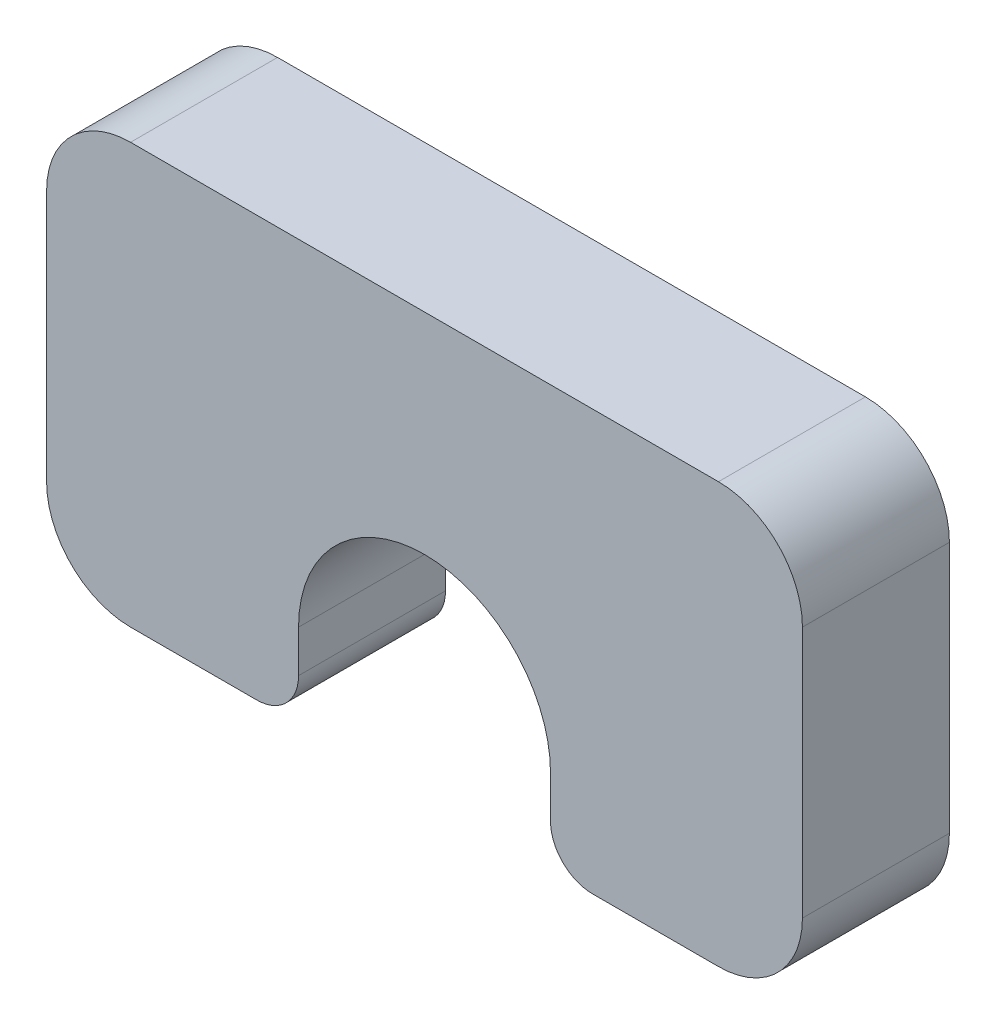
ISO-10303-21;
HEADER;
FILE_DESCRIPTION(('STEP AP214'),'2;1');
FILE_NAME('part.step','',(''),(''),'','','');
FILE_SCHEMA(('AUTOMOTIVE_DESIGN { 1 0 10303 214 1 1 1 1 }'));
ENDSEC;
DATA;
#1=APPLICATION_CONTEXT('core data for automotive mechanical design processes');
#2=APPLICATION_PROTOCOL_DEFINITION('international standard','automotive_design',2000,#1);
#3=PRODUCT_CONTEXT('',#1,'mechanical');
#4=PRODUCT('Part','Part','',(#3));
#5=PRODUCT_RELATED_PRODUCT_CATEGORY('part','',(#4));
#6=PRODUCT_DEFINITION_FORMATION('','',#4);
#7=PRODUCT_DEFINITION_CONTEXT('part definition',#1,'design');
#8=PRODUCT_DEFINITION('design','',#6,#7);
#9=PRODUCT_DEFINITION_SHAPE('','',#8);
#10=(LENGTH_UNIT() NAMED_UNIT(*) SI_UNIT(.MILLI.,.METRE.));
#11=(NAMED_UNIT(*) PLANE_ANGLE_UNIT() SI_UNIT($,.RADIAN.));
#12=(NAMED_UNIT(*) SI_UNIT($,.STERADIAN.) SOLID_ANGLE_UNIT());
#13=UNCERTAINTY_MEASURE_WITH_UNIT(LENGTH_MEASURE(1.E-05),#10,'distance_accuracy_value','');
#14=(GEOMETRIC_REPRESENTATION_CONTEXT(3) GLOBAL_UNCERTAINTY_ASSIGNED_CONTEXT((#13)) GLOBAL_UNIT_ASSIGNED_CONTEXT((#10,
#11,#12)) REPRESENTATION_CONTEXT('',''));
#15=CARTESIAN_POINT('',(0.,0.,0.));
#16=DIRECTION('',(0.,0.,1.));
#17=DIRECTION('',(1.,0.,0.));
#18=AXIS2_PLACEMENT_3D('',#15,#16,#17);
#19=CARTESIAN_POINT('',(13.,1.,1.75));
#20=DIRECTION('',(0.,0.,-1.));
#21=DIRECTION('',(-1.,0.,0.));
#22=AXIS2_PLACEMENT_3D('',#19,#20,#21);
#23=CYLINDRICAL_SURFACE('',#22,1.);
#24=CARTESIAN_POINT('',(13.,1.,-1.75));
#25=DIRECTION('',(0.,0.,1.));
#26=DIRECTION('',(1.,0.,0.));
#27=AXIS2_PLACEMENT_3D('',#24,#25,#26);
#28=CIRCLE('',#27,1.);
#29=CARTESIAN_POINT('',(12.,1.00000000000001,-1.75));
#30=VERTEX_POINT('',#29);
#31=CARTESIAN_POINT('',(13.,0.,-1.75));
#32=VERTEX_POINT('',#31);
#33=EDGE_CURVE('E174',#30,#32,#28,.T.);
#34=ORIENTED_EDGE('',*,*,#33,.T.);
#35=DIRECTION('',(0.,0.,-1.));
#36=VECTOR('',#35,1.);
#37=CARTESIAN_POINT('',(13.,0.,1.75));
#38=LINE('',#37,#36);
#39=CARTESIAN_POINT('',(13.,0.,1.75));
#40=VERTEX_POINT('',#39);
#41=EDGE_CURVE('E11',#40,#32,#38,.T.);
#42=ORIENTED_EDGE('',*,*,#41,.F.);
#43=CARTESIAN_POINT('',(13.,1.,1.75));
#44=DIRECTION('',(0.,0.,1.));
#45=DIRECTION('',(1.,0.,0.));
#46=AXIS2_PLACEMENT_3D('',#43,#44,#45);
#47=CIRCLE('',#46,1.);
#48=CARTESIAN_POINT('',(12.,1.00000000000001,1.75));
#49=VERTEX_POINT('',#48);
#50=EDGE_CURVE('E214',#49,#40,#47,.T.);
#51=ORIENTED_EDGE('',*,*,#50,.F.);
#52=DIRECTION('',(0.,0.,-1.));
#53=VECTOR('',#52,1.);
#54=CARTESIAN_POINT('',(12.,1.00000000000001,1.75));
#55=LINE('',#54,#53);
#56=EDGE_CURVE('E170',#49,#30,#55,.T.);
#57=ORIENTED_EDGE('',*,*,#56,.T.);
#58=EDGE_LOOP('',(#34,#42,#51,#57));
#59=FACE_BOUND('',#58,.T.);
#60=ADVANCED_FACE('F36',(#59),#23,.T.);
#61=CARTESIAN_POINT('',(13.,0.,1.75));
#62=DIRECTION('',(0.,1.,0.));
#63=DIRECTION('',(0.,0.,1.));
#64=AXIS2_PLACEMENT_3D('',#61,#62,#63);
#65=PLANE('',#64);
#66=DIRECTION('',(1.,0.,0.));
#67=VECTOR('',#66,1.);
#68=CARTESIAN_POINT('',(13.,0.,-1.75));
#69=LINE('',#68,#67);
#70=CARTESIAN_POINT('',(16.,0.,-1.75));
#71=VERTEX_POINT('',#70);
#72=EDGE_CURVE('E178',#32,#71,#69,.T.);
#73=ORIENTED_EDGE('',*,*,#72,.T.);
#74=DIRECTION('',(0.,0.,-1.));
#75=VECTOR('',#74,1.);
#76=CARTESIAN_POINT('',(16.,0.,1.75));
#77=LINE('',#76,#75);
#78=CARTESIAN_POINT('',(16.,0.,1.75));
#79=VERTEX_POINT('',#78);
#80=EDGE_CURVE('E45',#79,#71,#77,.T.);
#81=ORIENTED_EDGE('',*,*,#80,.F.);
#82=DIRECTION('',(1.,0.,0.));
#83=VECTOR('',#82,1.);
#84=CARTESIAN_POINT('',(13.,0.,1.75));
#85=LINE('',#84,#83);
#86=EDGE_CURVE('E114',#40,#79,#85,.T.);
#87=ORIENTED_EDGE('',*,*,#86,.F.);
#88=ORIENTED_EDGE('',*,*,#41,.T.);
#89=EDGE_LOOP('',(#73,#81,#87,#88));
#90=FACE_BOUND('',#89,.T.);
#91=ADVANCED_FACE('F331',(#90),#65,.F.);
#92=CARTESIAN_POINT('',(16.,2.,1.75));
#93=DIRECTION('',(0.,0.,-1.));
#94=DIRECTION('',(-1.,0.,0.));
#95=AXIS2_PLACEMENT_3D('',#92,#93,#94);
#96=CYLINDRICAL_SURFACE('',#95,2.);
#97=CARTESIAN_POINT('',(16.,2.,-1.75));
#98=DIRECTION('',(0.,0.,1.));
#99=DIRECTION('',(1.,0.,0.));
#100=AXIS2_PLACEMENT_3D('',#97,#98,#99);
#101=CIRCLE('',#100,2.);
#102=CARTESIAN_POINT('',(18.,2.00000000000001,-1.75));
#103=VERTEX_POINT('',#102);
#104=EDGE_CURVE('E181',#71,#103,#101,.T.);
#105=ORIENTED_EDGE('',*,*,#104,.T.);
#106=DIRECTION('',(0.,0.,-1.));
#107=VECTOR('',#106,1.);
#108=CARTESIAN_POINT('',(18.,2.00000000000001,1.75));
#109=LINE('',#108,#107);
#110=CARTESIAN_POINT('',(18.,2.00000000000001,1.75));
#111=VERTEX_POINT('',#110);
#112=EDGE_CURVE('E249',#111,#103,#109,.T.);
#113=ORIENTED_EDGE('',*,*,#112,.F.);
#114=CARTESIAN_POINT('',(16.,2.,1.75));
#115=DIRECTION('',(0.,0.,1.));
#116=DIRECTION('',(1.,0.,0.));
#117=AXIS2_PLACEMENT_3D('',#114,#115,#116);
#118=CIRCLE('',#117,2.);
#119=EDGE_CURVE('E260',#79,#111,#118,.T.);
#120=ORIENTED_EDGE('',*,*,#119,.F.);
#121=ORIENTED_EDGE('',*,*,#80,.T.);
#122=EDGE_LOOP('',(#105,#113,#120,#121));
#123=FACE_BOUND('',#122,.T.);
#124=ADVANCED_FACE('F258',(#123),#96,.T.);
#125=CARTESIAN_POINT('',(18.,2.00000000000001,1.75));
#126=DIRECTION('',(-1.,0.,0.));
#127=DIRECTION('',(0.,0.,1.));
#128=AXIS2_PLACEMENT_3D('',#125,#126,#127);
#129=PLANE('',#128);
#130=DIRECTION('',(0.,1.,0.));
#131=VECTOR('',#130,1.);
#132=CARTESIAN_POINT('',(18.,2.00000000000001,-1.75));
#133=LINE('',#132,#131);
#134=CARTESIAN_POINT('',(18.,7.99999999999998,-1.75));
#135=VERTEX_POINT('',#134);
#136=EDGE_CURVE('E184',#103,#135,#133,.T.);
#137=ORIENTED_EDGE('',*,*,#136,.T.);
#138=DIRECTION('',(0.,0.,-1.));
#139=VECTOR('',#138,1.);
#140=CARTESIAN_POINT('',(18.,7.99999999999998,1.75));
#141=LINE('',#140,#139);
#142=CARTESIAN_POINT('',(18.,7.99999999999998,1.75));
#143=VERTEX_POINT('',#142);
#144=EDGE_CURVE('E245',#143,#135,#141,.T.);
#145=ORIENTED_EDGE('',*,*,#144,.F.);
#146=DIRECTION('',(0.,1.,0.));
#147=VECTOR('',#146,1.);
#148=CARTESIAN_POINT('',(18.,2.00000000000001,1.75));
#149=LINE('',#148,#147);
#150=EDGE_CURVE('E279',#111,#143,#149,.T.);
#151=ORIENTED_EDGE('',*,*,#150,.F.);
#152=ORIENTED_EDGE('',*,*,#112,.T.);
#153=EDGE_LOOP('',(#137,#145,#151,#152));
#154=FACE_BOUND('',#153,.T.);
#155=ADVANCED_FACE('F269',(#154),#129,.F.);
#156=CARTESIAN_POINT('',(16.,8.,1.75));
#157=DIRECTION('',(0.,0.,-1.));
#158=DIRECTION('',(-1.,0.,0.));
#159=AXIS2_PLACEMENT_3D('',#156,#157,#158);
#160=CYLINDRICAL_SURFACE('',#159,2.);
#161=CARTESIAN_POINT('',(16.,8.,-1.75));
#162=DIRECTION('',(0.,0.,1.));
#163=DIRECTION('',(-1.,0.,0.));
#164=AXIS2_PLACEMENT_3D('',#161,#162,#163);
#165=CIRCLE('',#164,2.);
#166=CARTESIAN_POINT('',(16.,10.,-1.75));
#167=VERTEX_POINT('',#166);
#168=EDGE_CURVE('E187',#135,#167,#165,.T.);
#169=ORIENTED_EDGE('',*,*,#168,.T.);
#170=DIRECTION('',(0.,0.,-1.));
#171=VECTOR('',#170,1.);
#172=CARTESIAN_POINT('',(16.,10.,1.75));
#173=LINE('',#172,#171);
#174=CARTESIAN_POINT('',(16.,10.,1.75));
#175=VERTEX_POINT('',#174);
#176=EDGE_CURVE('E241',#175,#167,#173,.T.);
#177=ORIENTED_EDGE('',*,*,#176,.F.);
#178=CARTESIAN_POINT('',(16.,8.,1.75));
#179=DIRECTION('',(0.,0.,1.));
#180=DIRECTION('',(-1.,0.,0.));
#181=AXIS2_PLACEMENT_3D('',#178,#179,#180);
#182=CIRCLE('',#181,2.);
#183=EDGE_CURVE('E275',#143,#175,#182,.T.);
#184=ORIENTED_EDGE('',*,*,#183,.F.);
#185=ORIENTED_EDGE('',*,*,#144,.T.);
#186=EDGE_LOOP('',(#169,#177,#184,#185));
#187=FACE_BOUND('',#186,.T.);
#188=ADVANCED_FACE('F273',(#187),#160,.T.);
#189=CARTESIAN_POINT('',(2.00000000000001,10.,1.75));
#190=DIRECTION('',(0.,-1.,0.));
#191=DIRECTION('',(1.,0.,0.));
#192=AXIS2_PLACEMENT_3D('',#189,#190,#191);
#193=PLANE('',#192);
#194=DIRECTION('',(-1.,0.,0.));
#195=VECTOR('',#194,1.);
#196=CARTESIAN_POINT('',(2.00000000000001,10.,-1.75));
#197=LINE('',#196,#195);
#198=CARTESIAN_POINT('',(2.00000000000001,10.,-1.75));
#199=VERTEX_POINT('',#198);
#200=EDGE_CURVE('E190',#167,#199,#197,.T.);
#201=ORIENTED_EDGE('',*,*,#200,.T.);
#202=DIRECTION('',(0.,0.,-1.));
#203=VECTOR('',#202,1.);
#204=CARTESIAN_POINT('',(2.00000000000001,10.,1.75));
#205=LINE('',#204,#203);
#206=CARTESIAN_POINT('',(2.00000000000001,10.,1.75));
#207=VERTEX_POINT('',#206);
#208=EDGE_CURVE('E237',#207,#199,#205,.T.);
#209=ORIENTED_EDGE('',*,*,#208,.F.);
#210=DIRECTION('',(-1.,0.,0.));
#211=VECTOR('',#210,1.);
#212=CARTESIAN_POINT('',(2.00000000000001,10.,1.75));
#213=LINE('',#212,#211);
#214=EDGE_CURVE('E278',#175,#207,#213,.T.);
#215=ORIENTED_EDGE('',*,*,#214,.F.);
#216=ORIENTED_EDGE('',*,*,#176,.T.);
#217=EDGE_LOOP('',(#201,#209,#215,#216));
#218=FACE_BOUND('',#217,.T.);
#219=ADVANCED_FACE('F344',(#218),#193,.F.);
#220=CARTESIAN_POINT('',(2.,8.,1.75));
#221=DIRECTION('',(0.,0.,-1.));
#222=DIRECTION('',(-1.,0.,0.));
#223=AXIS2_PLACEMENT_3D('',#220,#221,#222);
#224=CYLINDRICAL_SURFACE('',#223,2.);
#225=CARTESIAN_POINT('',(2.,8.,-1.75));
#226=DIRECTION('',(0.,0.,1.));
#227=DIRECTION('',(-1.,0.,0.));
#228=AXIS2_PLACEMENT_3D('',#225,#226,#227);
#229=CIRCLE('',#228,2.);
#230=CARTESIAN_POINT('',(0.,7.99999999999999,-1.75));
#231=VERTEX_POINT('',#230);
#232=EDGE_CURVE('E193',#199,#231,#229,.T.);
#233=ORIENTED_EDGE('',*,*,#232,.T.);
#234=DIRECTION('',(0.,0.,-1.));
#235=VECTOR('',#234,1.);
#236=CARTESIAN_POINT('',(0.,7.99999999999999,1.75));
#237=LINE('',#236,#235);
#238=CARTESIAN_POINT('',(0.,7.99999999999999,1.75));
#239=VERTEX_POINT('',#238);
#240=EDGE_CURVE('E233',#239,#231,#237,.T.);
#241=ORIENTED_EDGE('',*,*,#240,.F.);
#242=CARTESIAN_POINT('',(2.,8.,1.75));
#243=DIRECTION('',(0.,0.,1.));
#244=DIRECTION('',(-1.,0.,0.));
#245=AXIS2_PLACEMENT_3D('',#242,#243,#244);
#246=CIRCLE('',#245,2.);
#247=EDGE_CURVE('E284',#207,#239,#246,.T.);
#248=ORIENTED_EDGE('',*,*,#247,.F.);
#249=ORIENTED_EDGE('',*,*,#208,.T.);
#250=EDGE_LOOP('',(#233,#241,#248,#249));
#251=FACE_BOUND('',#250,.T.);
#252=ADVANCED_FACE('F347',(#251),#224,.T.);
#253=CARTESIAN_POINT('',(0.,2.00000000000001,1.75));
#254=DIRECTION('',(1.,0.,0.));
#255=DIRECTION('',(0.,0.,-1.));
#256=AXIS2_PLACEMENT_3D('',#253,#254,#255);
#257=PLANE('',#256);
#258=DIRECTION('',(0.,-1.,0.));
#259=VECTOR('',#258,1.);
#260=CARTESIAN_POINT('',(0.,2.00000000000001,-1.75));
#261=LINE('',#260,#259);
#262=CARTESIAN_POINT('',(0.,2.,-1.75));
#263=VERTEX_POINT('',#262);
#264=EDGE_CURVE('E196',#231,#263,#261,.T.);
#265=ORIENTED_EDGE('',*,*,#264,.T.);
#266=DIRECTION('',(0.,0.,-1.));
#267=VECTOR('',#266,1.);
#268=CARTESIAN_POINT('',(0.,2.,1.75));
#269=LINE('',#268,#267);
#270=CARTESIAN_POINT('',(0.,2.,1.75));
#271=VERTEX_POINT('',#270);
#272=EDGE_CURVE('E229',#271,#263,#269,.T.);
#273=ORIENTED_EDGE('',*,*,#272,.F.);
#274=DIRECTION('',(0.,-1.,0.));
#275=VECTOR('',#274,1.);
#276=CARTESIAN_POINT('',(0.,2.00000000000001,1.75));
#277=LINE('',#276,#275);
#278=EDGE_CURVE('E291',#239,#271,#277,.T.);
#279=ORIENTED_EDGE('',*,*,#278,.F.);
#280=ORIENTED_EDGE('',*,*,#240,.T.);
#281=EDGE_LOOP('',(#265,#273,#279,#280));
#282=FACE_BOUND('',#281,.T.);
#283=ADVANCED_FACE('F351',(#282),#257,.F.);
#284=CARTESIAN_POINT('',(2.,2.,1.75));
#285=DIRECTION('',(0.,0.,-1.));
#286=DIRECTION('',(-1.,0.,0.));
#287=AXIS2_PLACEMENT_3D('',#284,#285,#286);
#288=CYLINDRICAL_SURFACE('',#287,2.);
#289=CARTESIAN_POINT('',(2.,2.,-1.75));
#290=DIRECTION('',(0.,0.,1.));
#291=DIRECTION('',(-1.,0.,0.));
#292=AXIS2_PLACEMENT_3D('',#289,#290,#291);
#293=CIRCLE('',#292,2.);
#294=CARTESIAN_POINT('',(2.00000000000001,0.,-1.75));
#295=VERTEX_POINT('',#294);
#296=EDGE_CURVE('E199',#263,#295,#293,.T.);
#297=ORIENTED_EDGE('',*,*,#296,.T.);
#298=DIRECTION('',(0.,0.,-1.));
#299=VECTOR('',#298,1.);
#300=CARTESIAN_POINT('',(2.00000000000001,0.,1.75));
#301=LINE('',#300,#299);
#302=CARTESIAN_POINT('',(2.00000000000001,0.,1.75));
#303=VERTEX_POINT('',#302);
#304=EDGE_CURVE('E225',#303,#295,#301,.T.);
#305=ORIENTED_EDGE('',*,*,#304,.F.);
#306=CARTESIAN_POINT('',(2.,2.,1.75));
#307=DIRECTION('',(0.,0.,1.));
#308=DIRECTION('',(-1.,0.,0.));
#309=AXIS2_PLACEMENT_3D('',#306,#307,#308);
#310=CIRCLE('',#309,2.);
#311=EDGE_CURVE('E294',#271,#303,#310,.T.);
#312=ORIENTED_EDGE('',*,*,#311,.F.);
#313=ORIENTED_EDGE('',*,*,#272,.T.);
#314=EDGE_LOOP('',(#297,#305,#312,#313));
#315=FACE_BOUND('',#314,.T.);
#316=ADVANCED_FACE('F355',(#315),#288,.T.);
#317=CARTESIAN_POINT('',(2.00000000000001,0.,1.75));
#318=DIRECTION('',(0.,1.,0.));
#319=DIRECTION('',(0.,0.,1.));
#320=AXIS2_PLACEMENT_3D('',#317,#318,#319);
#321=PLANE('',#320);
#322=DIRECTION('',(1.,0.,0.));
#323=VECTOR('',#322,1.);
#324=CARTESIAN_POINT('',(2.00000000000001,0.,-1.75));
#325=LINE('',#324,#323);
#326=CARTESIAN_POINT('',(4.99999999999999,0.,-1.75));
#327=VERTEX_POINT('',#326);
#328=EDGE_CURVE('E202',#295,#327,#325,.T.);
#329=ORIENTED_EDGE('',*,*,#328,.T.);
#330=DIRECTION('',(0.,0.,-1.));
#331=VECTOR('',#330,1.);
#332=CARTESIAN_POINT('',(4.99999999999999,0.,1.75));
#333=LINE('',#332,#331);
#334=CARTESIAN_POINT('',(4.99999999999999,0.,1.75));
#335=VERTEX_POINT('',#334);
#336=EDGE_CURVE('E221',#335,#327,#333,.T.);
#337=ORIENTED_EDGE('',*,*,#336,.F.);
#338=DIRECTION('',(1.,0.,0.));
#339=VECTOR('',#338,1.);
#340=CARTESIAN_POINT('',(2.00000000000001,0.,1.75));
#341=LINE('',#340,#339);
#342=EDGE_CURVE('E297',#303,#335,#341,.T.);
#343=ORIENTED_EDGE('',*,*,#342,.F.);
#344=ORIENTED_EDGE('',*,*,#304,.T.);
#345=EDGE_LOOP('',(#329,#337,#343,#344));
#346=FACE_BOUND('',#345,.T.);
#347=ADVANCED_FACE('F312',(#346),#321,.F.);
#348=CARTESIAN_POINT('',(5.,1.,1.75));
#349=DIRECTION('',(0.,0.,-1.));
#350=DIRECTION('',(-1.,0.,0.));
#351=AXIS2_PLACEMENT_3D('',#348,#349,#350);
#352=CYLINDRICAL_SURFACE('',#351,0.999999999999999);
#353=CARTESIAN_POINT('',(5.,1.,-1.75));
#354=DIRECTION('',(0.,0.,1.));
#355=DIRECTION('',(-1.,0.,0.));
#356=AXIS2_PLACEMENT_3D('',#353,#354,#355);
#357=CIRCLE('',#356,0.999999999999999);
#358=CARTESIAN_POINT('',(6.,1.,-1.75));
#359=VERTEX_POINT('',#358);
#360=EDGE_CURVE('E205',#327,#359,#357,.T.);
#361=ORIENTED_EDGE('',*,*,#360,.T.);
#362=DIRECTION('',(0.,0.,-1.));
#363=VECTOR('',#362,1.);
#364=CARTESIAN_POINT('',(6.,1.,1.75));
#365=LINE('',#364,#363);
#366=CARTESIAN_POINT('',(6.,1.,1.75));
#367=VERTEX_POINT('',#366);
#368=EDGE_CURVE('E162',#367,#359,#365,.T.);
#369=ORIENTED_EDGE('',*,*,#368,.F.);
#370=CARTESIAN_POINT('',(5.,1.,1.75));
#371=DIRECTION('',(0.,0.,1.));
#372=DIRECTION('',(-1.,0.,0.));
#373=AXIS2_PLACEMENT_3D('',#370,#371,#372);
#374=CIRCLE('',#373,0.999999999999999);
#375=EDGE_CURVE('E151',#335,#367,#374,.T.);
#376=ORIENTED_EDGE('',*,*,#375,.F.);
#377=ORIENTED_EDGE('',*,*,#336,.T.);
#378=EDGE_LOOP('',(#361,#369,#376,#377));
#379=FACE_BOUND('',#378,.T.);
#380=ADVANCED_FACE('F316',(#379),#352,.T.);
#381=CARTESIAN_POINT('',(6.,1.,1.75));
#382=DIRECTION('',(-1.,0.,0.));
#383=DIRECTION('',(0.,-1.,0.));
#384=AXIS2_PLACEMENT_3D('',#381,#382,#383);
#385=PLANE('',#384);
#386=DIRECTION('',(0.,1.,0.));
#387=VECTOR('',#386,1.);
#388=CARTESIAN_POINT('',(6.,1.,-1.75));
#389=LINE('',#388,#387);
#390=CARTESIAN_POINT('',(6.,2.,-1.75));
#391=VERTEX_POINT('',#390);
#392=EDGE_CURVE('E160',#359,#391,#389,.T.);
#393=ORIENTED_EDGE('',*,*,#392,.T.);
#394=DIRECTION('',(0.,0.,-1.));
#395=VECTOR('',#394,1.);
#396=CARTESIAN_POINT('',(6.,2.,1.75));
#397=LINE('',#396,#395);
#398=CARTESIAN_POINT('',(6.,2.,1.75));
#399=VERTEX_POINT('',#398);
#400=EDGE_CURVE('E157',#399,#391,#397,.T.);
#401=ORIENTED_EDGE('',*,*,#400,.F.);
#402=DIRECTION('',(0.,1.,0.));
#403=VECTOR('',#402,1.);
#404=CARTESIAN_POINT('',(6.,1.,1.75));
#405=LINE('',#404,#403);
#406=EDGE_CURVE('E145',#367,#399,#405,.T.);
#407=ORIENTED_EDGE('',*,*,#406,.F.);
#408=ORIENTED_EDGE('',*,*,#368,.T.);
#409=EDGE_LOOP('',(#393,#401,#407,#408));
#410=FACE_BOUND('',#409,.T.);
#411=ADVANCED_FACE('F158',(#410),#385,.F.);
#412=CARTESIAN_POINT('',(9.,2.,1.75));
#413=DIRECTION('',(0.,0.,-1.));
#414=DIRECTION('',(-1.,0.,0.));
#415=AXIS2_PLACEMENT_3D('',#412,#413,#414);
#416=CYLINDRICAL_SURFACE('',#415,3.);
#417=CARTESIAN_POINT('',(9.,2.,-1.75));
#418=DIRECTION('',(0.,0.,-1.));
#419=DIRECTION('',(1.,0.,0.));
#420=AXIS2_PLACEMENT_3D('',#417,#418,#419);
#421=CIRCLE('',#420,3.);
#422=CARTESIAN_POINT('',(12.,2.,-1.75));
#423=VERTEX_POINT('',#422);
#424=EDGE_CURVE('E100',#391,#423,#421,.T.);
#425=ORIENTED_EDGE('',*,*,#424,.T.);
#426=DIRECTION('',(0.,0.,-1.));
#427=VECTOR('',#426,1.);
#428=CARTESIAN_POINT('',(12.,2.,1.75));
#429=LINE('',#428,#427);
#430=CARTESIAN_POINT('',(12.,2.,1.75));
#431=VERTEX_POINT('',#430);
#432=EDGE_CURVE('E163',#431,#423,#429,.T.);
#433=ORIENTED_EDGE('',*,*,#432,.F.);
#434=CARTESIAN_POINT('',(9.,2.,1.75));
#435=DIRECTION('',(0.,0.,-1.));
#436=DIRECTION('',(1.,0.,0.));
#437=AXIS2_PLACEMENT_3D('',#434,#435,#436);
#438=CIRCLE('',#437,3.);
#439=EDGE_CURVE('E149',#399,#431,#438,.T.);
#440=ORIENTED_EDGE('',*,*,#439,.F.);
#441=ORIENTED_EDGE('',*,*,#400,.T.);
#442=EDGE_LOOP('',(#425,#433,#440,#441));
#443=FACE_BOUND('',#442,.T.);
#444=ADVANCED_FACE('F165',(#443),#416,.F.);
#445=CARTESIAN_POINT('',(12.,1.00000000000001,1.75));
#446=DIRECTION('',(1.,0.,0.));
#447=DIRECTION('',(0.,0.,-1.));
#448=AXIS2_PLACEMENT_3D('',#445,#446,#447);
#449=PLANE('',#448);
#450=DIRECTION('',(0.,-1.,0.));
#451=VECTOR('',#450,1.);
#452=CARTESIAN_POINT('',(12.,1.00000000000001,-1.75));
#453=LINE('',#452,#451);
#454=EDGE_CURVE('E106',#423,#30,#453,.T.);
#455=ORIENTED_EDGE('',*,*,#454,.T.);
#456=ORIENTED_EDGE('',*,*,#56,.F.);
#457=DIRECTION('',(0.,-1.,0.));
#458=VECTOR('',#457,1.);
#459=CARTESIAN_POINT('',(12.,1.00000000000001,1.75));
#460=LINE('',#459,#458);
#461=EDGE_CURVE('E53',#431,#49,#460,.T.);
#462=ORIENTED_EDGE('',*,*,#461,.F.);
#463=ORIENTED_EDGE('',*,*,#432,.T.);
#464=EDGE_LOOP('',(#455,#456,#462,#463));
#465=FACE_BOUND('',#464,.T.);
#466=ADVANCED_FACE('F320',(#465),#449,.F.);
#467=CARTESIAN_POINT('',(13.,1.,1.75));
#468=DIRECTION('',(0.,0.,1.));
#469=DIRECTION('',(1.,0.,0.));
#470=AXIS2_PLACEMENT_3D('',#467,#468,#469);
#471=PLANE('',#470);
#472=ORIENTED_EDGE('',*,*,#50,.T.);
#473=ORIENTED_EDGE('',*,*,#86,.T.);
#474=ORIENTED_EDGE('',*,*,#119,.T.);
#475=ORIENTED_EDGE('',*,*,#150,.T.);
#476=ORIENTED_EDGE('',*,*,#183,.T.);
#477=ORIENTED_EDGE('',*,*,#214,.T.);
#478=ORIENTED_EDGE('',*,*,#247,.T.);
#479=ORIENTED_EDGE('',*,*,#278,.T.);
#480=ORIENTED_EDGE('',*,*,#311,.T.);
#481=ORIENTED_EDGE('',*,*,#342,.T.);
#482=ORIENTED_EDGE('',*,*,#375,.T.);
#483=ORIENTED_EDGE('',*,*,#406,.T.);
#484=ORIENTED_EDGE('',*,*,#439,.T.);
#485=ORIENTED_EDGE('',*,*,#461,.T.);
#486=EDGE_LOOP('',(#472,#473,#474,#475,#476,#477,#478,#479,#480,#481,#482,#483,#484,#485));
#487=FACE_BOUND('',#486,.T.);
#488=ADVANCED_FACE('F147',(#487),#471,.T.);
#489=CARTESIAN_POINT('',(13.,1.,-1.75));
#490=DIRECTION('',(0.,0.,1.));
#491=DIRECTION('',(1.,0.,0.));
#492=AXIS2_PLACEMENT_3D('',#489,#490,#491);
#493=PLANE('',#492);
#494=ORIENTED_EDGE('',*,*,#33,.F.);
#495=ORIENTED_EDGE('',*,*,#454,.F.);
#496=ORIENTED_EDGE('',*,*,#424,.F.);
#497=ORIENTED_EDGE('',*,*,#392,.F.);
#498=ORIENTED_EDGE('',*,*,#360,.F.);
#499=ORIENTED_EDGE('',*,*,#328,.F.);
#500=ORIENTED_EDGE('',*,*,#296,.F.);
#501=ORIENTED_EDGE('',*,*,#264,.F.);
#502=ORIENTED_EDGE('',*,*,#232,.F.);
#503=ORIENTED_EDGE('',*,*,#200,.F.);
#504=ORIENTED_EDGE('',*,*,#168,.F.);
#505=ORIENTED_EDGE('',*,*,#136,.F.);
#506=ORIENTED_EDGE('',*,*,#104,.F.);
#507=ORIENTED_EDGE('',*,*,#72,.F.);
#508=EDGE_LOOP('',(#494,#495,#496,#497,#498,#499,#500,#501,#502,#503,#504,#505,#506,#507));
#509=FACE_BOUND('',#508,.T.);
#510=ADVANCED_FACE('F264',(#509),#493,.F.);
#511=CLOSED_SHELL('',(#60,#91,#124,#155,#188,#219,#252,#283,#316,#347,#380,#411,#444,#466,#488,#510));
#512=MANIFOLD_SOLID_BREP('B2',#511);
#513=ADVANCED_BREP_SHAPE_REPRESENTATION('',(#18,#512),#14);
#514=SHAPE_DEFINITION_REPRESENTATION(#9,#513);
ENDSEC;
END-ISO-10303-21;
